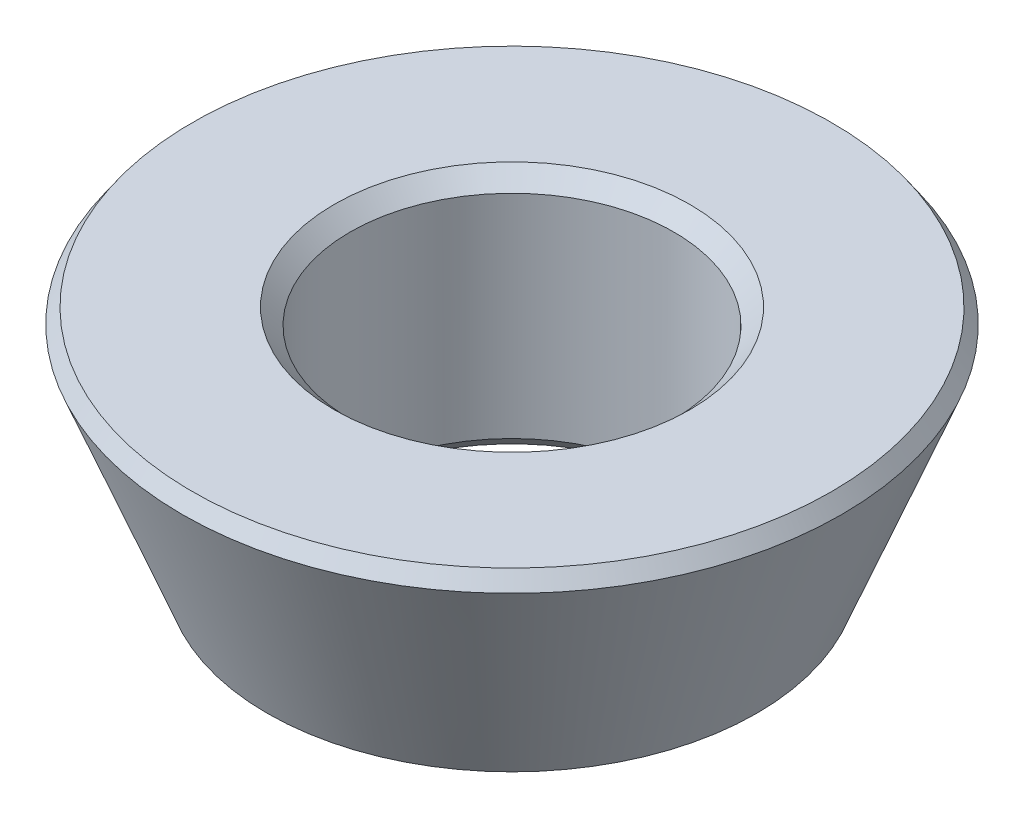
ISO-10303-21;
HEADER;
FILE_DESCRIPTION(('STEP AP214'),'2;1');
FILE_NAME('part.step','',(''),(''),'','','');
FILE_SCHEMA(('AUTOMOTIVE_DESIGN { 1 0 10303 214 1 1 1 1 }'));
ENDSEC;
DATA;
#1=APPLICATION_CONTEXT('core data for automotive mechanical design processes');
#2=APPLICATION_PROTOCOL_DEFINITION('international standard','automotive_design',2000,#1);
#3=PRODUCT_CONTEXT('',#1,'mechanical');
#4=PRODUCT('Part','Part','',(#3));
#5=PRODUCT_RELATED_PRODUCT_CATEGORY('part','',(#4));
#6=PRODUCT_DEFINITION_FORMATION('','',#4);
#7=PRODUCT_DEFINITION_CONTEXT('part definition',#1,'design');
#8=PRODUCT_DEFINITION('design','',#6,#7);
#9=PRODUCT_DEFINITION_SHAPE('','',#8);
#10=(LENGTH_UNIT() NAMED_UNIT(*) SI_UNIT(.MILLI.,.METRE.));
#11=(NAMED_UNIT(*) PLANE_ANGLE_UNIT() SI_UNIT($,.RADIAN.));
#12=(NAMED_UNIT(*) SI_UNIT($,.STERADIAN.) SOLID_ANGLE_UNIT());
#13=UNCERTAINTY_MEASURE_WITH_UNIT(LENGTH_MEASURE(1.E-05),#10,'distance_accuracy_value','');
#14=(GEOMETRIC_REPRESENTATION_CONTEXT(3) GLOBAL_UNCERTAINTY_ASSIGNED_CONTEXT((#13)) GLOBAL_UNIT_ASSIGNED_CONTEXT((#10,
#11,#12)) REPRESENTATION_CONTEXT('',''));
#15=CARTESIAN_POINT('',(0.,0.,0.));
#16=DIRECTION('',(0.,0.,1.));
#17=DIRECTION('',(1.,0.,0.));
#18=AXIS2_PLACEMENT_3D('',#15,#16,#17);
#19=CARTESIAN_POINT('',(0.,4.6,0.));
#20=DIRECTION('',(0.,-1.,0.));
#21=DIRECTION('',(1.,0.,0.));
#22=AXIS2_PLACEMENT_3D('',#19,#20,#21);
#23=PLANE('',#22);
#24=CARTESIAN_POINT('',(0.,4.6,0.));
#25=DIRECTION('',(0.,-1.,0.));
#26=DIRECTION('',(1.,0.,0.));
#27=AXIS2_PLACEMENT_3D('',#24,#25,#26);
#28=CIRCLE('',#27,6.01983867);
#29=CARTESIAN_POINT('',(6.01983867,4.6,0.));
#30=VERTEX_POINT('',#29);
#31=EDGE_CURVE('E44',#30,#30,#28,.F.);
#32=ORIENTED_EDGE('',*,*,#31,.T.);
#33=EDGE_LOOP('',(#32));
#34=FACE_BOUND('',#33,.T.);
#35=CARTESIAN_POINT('',(0.,4.6,0.));
#36=DIRECTION('',(0.,-1.,0.));
#37=DIRECTION('',(1.,0.,0.));
#38=AXIS2_PLACEMENT_3D('',#35,#36,#37);
#39=CIRCLE('',#38,3.35);
#40=CARTESIAN_POINT('',(3.35,4.6,0.));
#41=VERTEX_POINT('',#40);
#42=EDGE_CURVE('E48',#41,#41,#39,.T.);
#43=ORIENTED_EDGE('',*,*,#42,.T.);
#44=EDGE_LOOP('',(#43));
#45=FACE_BOUND('',#44,.T.);
#46=ADVANCED_FACE('F32',(#34,#45),#23,.F.);
#47=CARTESIAN_POINT('',(0.,4.6,0.));
#48=DIRECTION('',(0.,1.,0.));
#49=DIRECTION('',(-1.,0.,0.));
#50=AXIS2_PLACEMENT_3D('',#47,#48,#49);
#51=CYLINDRICAL_SURFACE('',#50,3.05);
#52=CARTESIAN_POINT('',(0.,4.3,0.));
#53=DIRECTION('',(0.,-1.,0.));
#54=DIRECTION('',(1.,0.,0.));
#55=AXIS2_PLACEMENT_3D('',#52,#53,#54);
#56=CIRCLE('',#55,3.05);
#57=CARTESIAN_POINT('',(3.05,4.3,0.));
#58=VERTEX_POINT('',#57);
#59=EDGE_CURVE('E10',#58,#58,#56,.F.);
#60=ORIENTED_EDGE('',*,*,#59,.T.);
#61=EDGE_LOOP('',(#60));
#62=FACE_BOUND('',#61,.T.);
#63=CARTESIAN_POINT('',(0.,0.299999999999999,0.));
#64=DIRECTION('',(0.,1.,0.));
#65=DIRECTION('',(-1.,0.,0.));
#66=AXIS2_PLACEMENT_3D('',#63,#64,#65);
#67=CIRCLE('',#66,3.05);
#68=CARTESIAN_POINT('',(-3.05,0.299999999999999,0.));
#69=VERTEX_POINT('',#68);
#70=EDGE_CURVE('E40',#69,#69,#67,.F.);
#71=ORIENTED_EDGE('',*,*,#70,.T.);
#72=EDGE_LOOP('',(#71));
#73=FACE_BOUND('',#72,.T.);
#74=ADVANCED_FACE('F78',(#62,#73),#51,.F.);
#75=CARTESIAN_POINT('',(0.,0.,0.));
#76=DIRECTION('',(0.,1.,0.));
#77=DIRECTION('',(-1.,0.,0.));
#78=AXIS2_PLACEMENT_3D('',#75,#76,#77);
#79=PLANE('',#78);
#80=CARTESIAN_POINT('',(0.,0.,0.));
#81=DIRECTION('',(0.,1.,0.));
#82=DIRECTION('',(-1.,0.,0.));
#83=AXIS2_PLACEMENT_3D('',#80,#81,#82);
#84=CIRCLE('',#83,4.2);
#85=CARTESIAN_POINT('',(-4.2,0.,0.));
#86=VERTEX_POINT('',#85);
#87=EDGE_CURVE('E53',#86,#86,#84,.F.);
#88=ORIENTED_EDGE('',*,*,#87,.T.);
#89=EDGE_LOOP('',(#88));
#90=FACE_BOUND('',#89,.T.);
#91=CARTESIAN_POINT('',(0.,0.,0.));
#92=DIRECTION('',(0.,1.,0.));
#93=DIRECTION('',(-1.,0.,0.));
#94=AXIS2_PLACEMENT_3D('',#91,#92,#93);
#95=CIRCLE('',#94,3.35);
#96=CARTESIAN_POINT('',(-3.35,0.,0.));
#97=VERTEX_POINT('',#96);
#98=EDGE_CURVE('E56',#97,#97,#95,.T.);
#99=ORIENTED_EDGE('',*,*,#98,.T.);
#100=EDGE_LOOP('',(#99));
#101=FACE_BOUND('',#100,.T.);
#102=ADVANCED_FACE('F103',(#90,#101),#79,.F.);
#103=CARTESIAN_POINT('',(0.,0.,0.));
#104=DIRECTION('',(0.,1.,0.));
#105=DIRECTION('',(-1.,0.,0.));
#106=AXIS2_PLACEMENT_3D('',#103,#104,#105);
#107=CONICAL_SURFACE('',#106,4.5,0.376722315933289);
#108=CARTESIAN_POINT('',(0.,0.278962621528744,0.));
#109=DIRECTION('',(0.,-1.,0.));
#110=DIRECTION('',(1.,0.,0.));
#111=AXIS2_PLACEMENT_3D('',#108,#109,#110);
#112=CIRCLE('',#111,4.61036238394404);
#113=CARTESIAN_POINT('',(4.61036238394404,0.278962621528744,0.));
#114=VERTEX_POINT('',#113);
#115=EDGE_CURVE('E59',#114,#114,#112,.F.);
#116=ORIENTED_EDGE('',*,*,#115,.T.);
#117=EDGE_LOOP('',(#116));
#118=FACE_BOUND('',#117,.T.);
#119=CARTESIAN_POINT('',(0.,4.32103737847125,0.));
#120=DIRECTION('',(0.,-1.,0.));
#121=DIRECTION('',(1.,0.,0.));
#122=AXIS2_PLACEMENT_3D('',#119,#120,#121);
#123=CIRCLE('',#122,6.20947628605596);
#124=CARTESIAN_POINT('',(6.20947628605596,4.32103737847125,0.));
#125=VERTEX_POINT('',#124);
#126=EDGE_CURVE('E62',#125,#125,#123,.T.);
#127=ORIENTED_EDGE('',*,*,#126,.T.);
#128=EDGE_LOOP('',(#127));
#129=FACE_BOUND('',#128,.T.);
#130=ADVANCED_FACE('F66',(#118,#129),#107,.T.);
#131=CARTESIAN_POINT('',(0.,0.278962621528744,0.));
#132=DIRECTION('',(0.,1.,0.));
#133=DIRECTION('',(-1.,0.,0.));
#134=AXIS2_PLACEMENT_3D('',#131,#132,#133);
#135=CONICAL_SURFACE('',#134,4.61036238394404,0.973759321364094);
#136=ORIENTED_EDGE('',*,*,#87,.F.);
#137=EDGE_LOOP('',(#136));
#138=FACE_BOUND('',#137,.T.);
#139=ORIENTED_EDGE('',*,*,#115,.F.);
#140=EDGE_LOOP('',(#139));
#141=FACE_BOUND('',#140,.T.);
#142=ADVANCED_FACE('F72',(#138,#141),#135,.T.);
#143=CARTESIAN_POINT('',(0.,4.6,0.));
#144=DIRECTION('',(0.,-1.,0.));
#145=DIRECTION('',(1.,0.,0.));
#146=AXIS2_PLACEMENT_3D('',#143,#144,#145);
#147=CONICAL_SURFACE('',#146,6.01983867,0.597037005430801);
#148=ORIENTED_EDGE('',*,*,#126,.F.);
#149=EDGE_LOOP('',(#148));
#150=FACE_BOUND('',#149,.T.);
#151=ORIENTED_EDGE('',*,*,#31,.F.);
#152=EDGE_LOOP('',(#151));
#153=FACE_BOUND('',#152,.T.);
#154=ADVANCED_FACE('F68',(#150,#153),#147,.T.);
#155=CARTESIAN_POINT('',(0.,4.3,0.));
#156=DIRECTION('',(0.,1.,0.));
#157=DIRECTION('',(-1.,0.,0.));
#158=AXIS2_PLACEMENT_3D('',#155,#156,#157);
#159=CONICAL_SURFACE('',#158,3.05,0.785398163397448);
#160=ORIENTED_EDGE('',*,*,#42,.F.);
#161=EDGE_LOOP('',(#160));
#162=FACE_BOUND('',#161,.T.);
#163=ORIENTED_EDGE('',*,*,#59,.F.);
#164=EDGE_LOOP('',(#163));
#165=FACE_BOUND('',#164,.T.);
#166=ADVANCED_FACE('F71',(#162,#165),#159,.F.);
#167=CARTESIAN_POINT('',(0.,0.,0.));
#168=DIRECTION('',(0.,-1.,0.));
#169=DIRECTION('',(1.,0.,0.));
#170=AXIS2_PLACEMENT_3D('',#167,#168,#169);
#171=CONICAL_SURFACE('',#170,3.35,0.785398163397451);
#172=ORIENTED_EDGE('',*,*,#70,.F.);
#173=EDGE_LOOP('',(#172));
#174=FACE_BOUND('',#173,.T.);
#175=ORIENTED_EDGE('',*,*,#98,.F.);
#176=EDGE_LOOP('',(#175));
#177=FACE_BOUND('',#176,.T.);
#178=ADVANCED_FACE('F35',(#174,#177),#171,.F.);
#179=CLOSED_SHELL('',(#46,#74,#102,#130,#142,#154,#166,#178));
#180=MANIFOLD_SOLID_BREP('B2',#179);
#181=ADVANCED_BREP_SHAPE_REPRESENTATION('',(#18,#180),#14);
#182=SHAPE_DEFINITION_REPRESENTATION(#9,#181);
ENDSEC;
END-ISO-10303-21;
